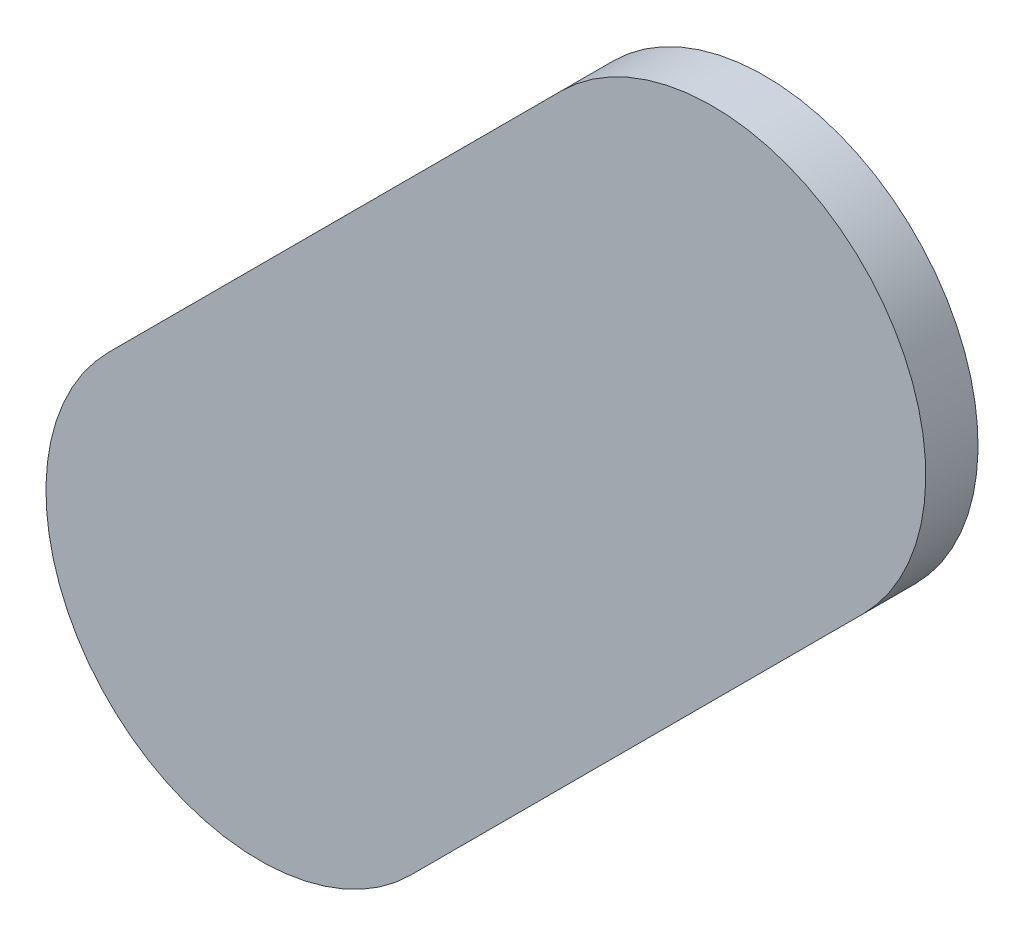
ISO-10303-21;
HEADER;
FILE_DESCRIPTION(('STEP AP214'),'2;1');
FILE_NAME('part.step','',(''),(''),'','','');
FILE_SCHEMA(('AUTOMOTIVE_DESIGN { 1 0 10303 214 1 1 1 1 }'));
ENDSEC;
DATA;
#1=APPLICATION_CONTEXT('core data for automotive mechanical design processes');
#2=APPLICATION_PROTOCOL_DEFINITION('international standard','automotive_design',2000,#1);
#3=PRODUCT_CONTEXT('',#1,'mechanical');
#4=PRODUCT('Part','Part','',(#3));
#5=PRODUCT_RELATED_PRODUCT_CATEGORY('part','',(#4));
#6=PRODUCT_DEFINITION_FORMATION('','',#4);
#7=PRODUCT_DEFINITION_CONTEXT('part definition',#1,'design');
#8=PRODUCT_DEFINITION('design','',#6,#7);
#9=PRODUCT_DEFINITION_SHAPE('','',#8);
#10=(LENGTH_UNIT() NAMED_UNIT(*) SI_UNIT(.MILLI.,.METRE.));
#11=(NAMED_UNIT(*) PLANE_ANGLE_UNIT() SI_UNIT($,.RADIAN.));
#12=(NAMED_UNIT(*) SI_UNIT($,.STERADIAN.) SOLID_ANGLE_UNIT());
#13=UNCERTAINTY_MEASURE_WITH_UNIT(LENGTH_MEASURE(1.E-05),#10,'distance_accuracy_value','');
#14=(GEOMETRIC_REPRESENTATION_CONTEXT(3) GLOBAL_UNCERTAINTY_ASSIGNED_CONTEXT((#13)) GLOBAL_UNIT_ASSIGNED_CONTEXT((#10,
#11,#12)) REPRESENTATION_CONTEXT('',''));
#15=CARTESIAN_POINT('',(0.,0.,0.));
#16=DIRECTION('',(0.,0.,1.));
#17=DIRECTION('',(1.,0.,0.));
#18=AXIS2_PLACEMENT_3D('',#15,#16,#17);
#19=CARTESIAN_POINT('',(7.190858089748,6.617304644465,0.79916));
#20=DIRECTION('',(0.,0.,1.));
#21=DIRECTION('',(1.,0.,0.));
#22=AXIS2_PLACEMENT_3D('',#19,#20,#21);
#23=PLANE('',#22);
#24=CARTESIAN_POINT('',(7.042365333,6.468812,0.79916));
#25=DIRECTION('',(0.,0.,1.));
#26=DIRECTION('',(1.,0.,0.));
#27=AXIS2_PLACEMENT_3D('',#24,#25,#26);
#28=CIRCLE('',#27,0.139999666);
#29=CARTESIAN_POINT('',(7.14136065012217,6.36981731612202,0.79916));
#30=VERTEX_POINT('',#29);
#31=CARTESIAN_POINT('',(6.94337073875643,6.56780683214002,0.79916));
#32=VERTEX_POINT('',#31);
#33=EDGE_CURVE('E20',#30,#32,#28,.F.);
#34=ORIENTED_EDGE('',*,*,#33,.F.);
#35=DIRECTION('',(-0.707106660628037,-0.707106901745037,0.));
#36=VECTOR('',#35,1.);
#37=CARTESIAN_POINT('',(7.438345282866,6.666802050135,0.79916));
#38=LINE('',#37,#36);
#39=CARTESIAN_POINT('',(7.43834545805482,6.66680222532388,0.79916));
#40=VERTEX_POINT('',#39);
#41=EDGE_CURVE('E65',#30,#40,#38,.F.);
#42=ORIENTED_EDGE('',*,*,#41,.T.);
#43=CARTESIAN_POINT('',(7.339350333,6.765797101268,0.79916));
#44=DIRECTION('',(0.,0.,1.));
#45=DIRECTION('',(1.,0.,0.));
#46=AXIS2_PLACEMENT_3D('',#43,#44,#45);
#47=CIRCLE('',#46,0.14);
#48=CARTESIAN_POINT('',(7.2403553105155,6.86479197751572,0.79916));
#49=VERTEX_POINT('',#48);
#50=EDGE_CURVE('E57',#49,#40,#47,.F.);
#51=ORIENTED_EDGE('',*,*,#50,.F.);
#52=DIRECTION('',(0.707106098309218,0.707107464063218,0.));
#53=VECTOR('',#52,1.);
#54=CARTESIAN_POINT('',(6.943370953307,6.567807046691,0.79916));
#55=LINE('',#54,#53);
#56=EDGE_CURVE('E64',#49,#32,#55,.F.);
#57=ORIENTED_EDGE('',*,*,#56,.T.);
#58=EDGE_LOOP('',(#34,#42,#51,#57));
#59=FACE_BOUND('',#58,.T.);
#60=ADVANCED_FACE('F17',(#59),#23,.T.);
#61=CARTESIAN_POINT('',(7.438345282866,6.666802050135,0.76487));
#62=DIRECTION('',(-0.707106901745037,0.707106660628037,0.));
#63=DIRECTION('',(-0.707106660628037,-0.707106901745037,0.));
#64=AXIS2_PLACEMENT_3D('',#61,#62,#63);
#65=PLANE('',#64);
#66=DIRECTION('',(0.,0.,1.));
#67=VECTOR('',#66,1.);
#68=CARTESIAN_POINT('',(7.1413606670001,6.3698173329999,0.76487));
#69=LINE('',#68,#67);
#70=CARTESIAN_POINT('',(7.14136065012214,6.36981731612203,0.76487));
#71=VERTEX_POINT('',#70);
#72=EDGE_CURVE('E68',#71,#30,#69,.T.);
#73=ORIENTED_EDGE('',*,*,#72,.F.);
#74=DIRECTION('',(-0.707106660628132,-0.707106901744942,0.));
#75=VECTOR('',#74,1.);
#76=CARTESIAN_POINT('',(7.438345282866,6.666802050135,0.76487));
#77=LINE('',#76,#75);
#78=CARTESIAN_POINT('',(7.43834545805481,6.66680222532387,0.76487));
#79=VERTEX_POINT('',#78);
#80=EDGE_CURVE('E72',#79,#71,#77,.T.);
#81=ORIENTED_EDGE('',*,*,#80,.F.);
#82=DIRECTION('',(0.,0.,1.));
#83=VECTOR('',#82,1.);
#84=CARTESIAN_POINT('',(7.438345282866,6.666802050135,0.76487));
#85=LINE('',#84,#83);
#86=EDGE_CURVE('E60',#40,#79,#85,.F.);
#87=ORIENTED_EDGE('',*,*,#86,.F.);
#88=ORIENTED_EDGE('',*,*,#41,.F.);
#89=EDGE_LOOP('',(#73,#81,#87,#88));
#90=FACE_BOUND('',#89,.T.);
#91=ADVANCED_FACE('F70',(#90),#65,.F.);
#92=CARTESIAN_POINT('',(7.042365333,6.468812,0.76487));
#93=DIRECTION('',(0.,0.,1.));
#94=DIRECTION('',(1.,0.,0.));
#95=AXIS2_PLACEMENT_3D('',#92,#93,#94);
#96=CYLINDRICAL_SURFACE('',#95,0.139999666);
#97=DIRECTION('',(0.,0.,1.));
#98=VECTOR('',#97,1.);
#99=CARTESIAN_POINT('',(6.943370953307,6.567807046691,0.76487));
#100=LINE('',#99,#98);
#101=CARTESIAN_POINT('',(6.94337073875646,6.56780683214004,0.76487));
#102=VERTEX_POINT('',#101);
#103=EDGE_CURVE('E77',#32,#102,#100,.F.);
#104=ORIENTED_EDGE('',*,*,#103,.T.);
#105=CARTESIAN_POINT('',(7.042365667,6.468812231732,0.76487));
#106=DIRECTION('',(0.,0.,1.));
#107=DIRECTION('',(1.,0.,0.));
#108=AXIS2_PLACEMENT_3D('',#105,#106,#107);
#109=CIRCLE('',#108,0.14);
#110=EDGE_CURVE('E26',#71,#102,#109,.F.);
#111=ORIENTED_EDGE('',*,*,#110,.F.);
#112=ORIENTED_EDGE('',*,*,#72,.T.);
#113=ORIENTED_EDGE('',*,*,#33,.T.);
#114=EDGE_LOOP('',(#104,#111,#112,#113));
#115=FACE_BOUND('',#114,.T.);
#116=ADVANCED_FACE('F88',(#115),#96,.T.);
#117=CARTESIAN_POINT('',(6.943370953307,6.567807046691,0.76487));
#118=DIRECTION('',(0.707107464063218,-0.707106098309218,0.));
#119=DIRECTION('',(0.707106098309218,0.707107464063218,0.));
#120=AXIS2_PLACEMENT_3D('',#117,#118,#119);
#121=PLANE('',#120);
#122=DIRECTION('',(0.,0.,1.));
#123=VECTOR('',#122,1.);
#124=CARTESIAN_POINT('',(7.2403553329999,6.8647920000001,0.76487));
#125=LINE('',#124,#123);
#126=CARTESIAN_POINT('',(7.24035531051561,6.86479197751567,0.76487));
#127=VERTEX_POINT('',#126);
#128=EDGE_CURVE('E62',#127,#49,#125,.T.);
#129=ORIENTED_EDGE('',*,*,#128,.F.);
#130=DIRECTION('',(0.707106098309611,0.707107464062825,0.));
#131=VECTOR('',#130,1.);
#132=CARTESIAN_POINT('',(6.943370953307,6.567807046691,0.76487));
#133=LINE('',#132,#131);
#134=EDGE_CURVE('E11',#102,#127,#133,.T.);
#135=ORIENTED_EDGE('',*,*,#134,.F.);
#136=ORIENTED_EDGE('',*,*,#103,.F.);
#137=ORIENTED_EDGE('',*,*,#56,.F.);
#138=EDGE_LOOP('',(#129,#135,#136,#137));
#139=FACE_BOUND('',#138,.T.);
#140=ADVANCED_FACE('F96',(#139),#121,.F.);
#141=CARTESIAN_POINT('',(7.339350333,6.765797101268,0.76487));
#142=DIRECTION('',(0.,0.,1.));
#143=DIRECTION('',(1.,0.,0.));
#144=AXIS2_PLACEMENT_3D('',#141,#142,#143);
#145=CYLINDRICAL_SURFACE('',#144,0.14);
#146=CARTESIAN_POINT('',(7.339350667,6.765797333,0.76487));
#147=DIRECTION('',(0.,0.,1.));
#148=DIRECTION('',(1.,0.,0.));
#149=AXIS2_PLACEMENT_3D('',#146,#147,#148);
#150=CIRCLE('',#149,0.14);
#151=EDGE_CURVE('E35',#127,#79,#150,.F.);
#152=ORIENTED_EDGE('',*,*,#151,.F.);
#153=ORIENTED_EDGE('',*,*,#128,.T.);
#154=ORIENTED_EDGE('',*,*,#50,.T.);
#155=ORIENTED_EDGE('',*,*,#86,.T.);
#156=EDGE_LOOP('',(#152,#153,#154,#155));
#157=FACE_BOUND('',#156,.T.);
#158=ADVANCED_FACE('F58',(#157),#145,.T.);
#159=CARTESIAN_POINT('',(7.190858089748,6.617304644465,0.76487));
#160=DIRECTION('',(0.,0.,-1.));
#161=DIRECTION('',(-1.,0.,0.));
#162=AXIS2_PLACEMENT_3D('',#159,#160,#161);
#163=PLANE('',#162);
#164=ORIENTED_EDGE('',*,*,#134,.T.);
#165=ORIENTED_EDGE('',*,*,#151,.T.);
#166=ORIENTED_EDGE('',*,*,#80,.T.);
#167=ORIENTED_EDGE('',*,*,#110,.T.);
#168=EDGE_LOOP('',(#164,#165,#166,#167));
#169=FACE_BOUND('',#168,.T.);
#170=ADVANCED_FACE('F89',(#169),#163,.T.);
#171=CLOSED_SHELL('',(#60,#91,#116,#140,#158,#170));
#172=MANIFOLD_SOLID_BREP('B1',#171);
#173=ADVANCED_BREP_SHAPE_REPRESENTATION('',(#18,#172),#14);
#174=SHAPE_DEFINITION_REPRESENTATION(#9,#173);
ENDSEC;
END-ISO-10303-21;
